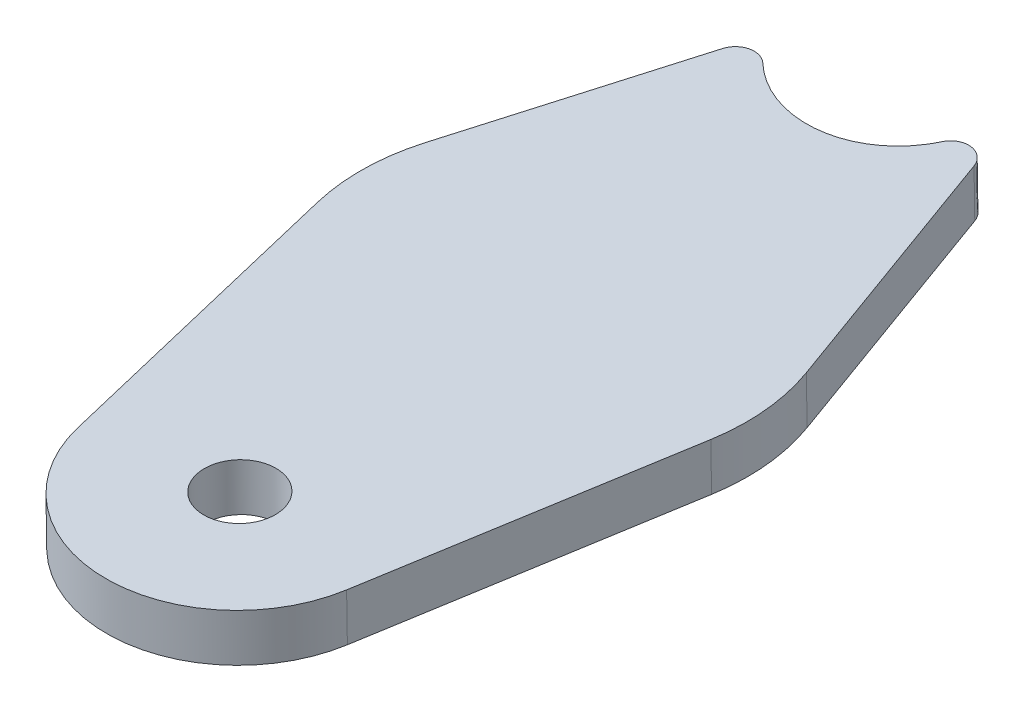
ISO-10303-21;
HEADER;
FILE_DESCRIPTION(('STEP AP214'),'2;1');
FILE_NAME('part.step','',(''),(''),'','','');
FILE_SCHEMA(('AUTOMOTIVE_DESIGN { 1 0 10303 214 1 1 1 1 }'));
ENDSEC;
DATA;
#1=APPLICATION_CONTEXT('core data for automotive mechanical design processes');
#2=APPLICATION_PROTOCOL_DEFINITION('international standard','automotive_design',2000,#1);
#3=PRODUCT_CONTEXT('',#1,'mechanical');
#4=PRODUCT('Part','Part','',(#3));
#5=PRODUCT_RELATED_PRODUCT_CATEGORY('part','',(#4));
#6=PRODUCT_DEFINITION_FORMATION('','',#4);
#7=PRODUCT_DEFINITION_CONTEXT('part definition',#1,'design');
#8=PRODUCT_DEFINITION('design','',#6,#7);
#9=PRODUCT_DEFINITION_SHAPE('','',#8);
#10=(LENGTH_UNIT() NAMED_UNIT(*) SI_UNIT(.MILLI.,.METRE.));
#11=(NAMED_UNIT(*) PLANE_ANGLE_UNIT() SI_UNIT($,.RADIAN.));
#12=(NAMED_UNIT(*) SI_UNIT($,.STERADIAN.) SOLID_ANGLE_UNIT());
#13=UNCERTAINTY_MEASURE_WITH_UNIT(LENGTH_MEASURE(1.E-05),#10,'distance_accuracy_value','');
#14=(GEOMETRIC_REPRESENTATION_CONTEXT(3) GLOBAL_UNCERTAINTY_ASSIGNED_CONTEXT((#13)) GLOBAL_UNIT_ASSIGNED_CONTEXT((#10,
#11,#12)) REPRESENTATION_CONTEXT('',''));
#15=CARTESIAN_POINT('',(0.,0.,0.));
#16=DIRECTION('',(0.,0.,1.));
#17=DIRECTION('',(1.,0.,0.));
#18=AXIS2_PLACEMENT_3D('',#15,#16,#17);
#19=CARTESIAN_POINT('',(-0.370440133779489,-19.1401560113368,83.5571213982127));
#20=DIRECTION('',(0.0233348115766651,0.998968886682012,0.0389441909658332));
#21=DIRECTION('',(0.,-0.0389547981153577,0.999240973791503));
#22=AXIS2_PLACEMENT_3D('',#19,#20,#21);
#23=PLANE('',#22);
#24=DIRECTION('',(-0.201552589425748,0.0428558176093111,-0.978539693928056));
#25=VECTOR('',#24,1.);
#26=CARTESIAN_POINT('',(-27.1213154377897,-16.8749209764209,41.4796601508919));
#27=LINE('',#26,#25);
#28=CARTESIAN_POINT('',(-17.7162160176897,-18.8747128247599,87.141505201501));
#29=VERTEX_POINT('',#28);
#30=CARTESIAN_POINT('',(-25.7495667571363,-17.1665937920934,48.1395127379373));
#31=VERTEX_POINT('',#30);
#32=EDGE_CURVE('E234',#29,#31,#27,.T.);
#33=ORIENTED_EDGE('',*,*,#32,.T.);
#34=CARTESIAN_POINT('',(-0.877894535570292,-17.5472061079778,42.9999548612343));
#35=DIRECTION('',(0.0233348115766651,0.998968886682012,0.0389441909658332));
#36=DIRECTION('',(0.,-0.0389547981153577,0.999240973791503));
#37=AXIS2_PLACEMENT_3D('',#34,#35,#36);
#38=CIRCLE('',#37,25.4);
#39=CARTESIAN_POINT('',(-24.9771123997532,-16.6733172897904,35.0234884337932));
#40=VERTEX_POINT('',#39);
#41=EDGE_CURVE('E263',#31,#40,#38,.F.);
#42=ORIENTED_EDGE('',*,*,#41,.T.);
#43=DIRECTION('',(0.315050184239988,0.0296218583266938,-0.948612632700842));
#44=VECTOR('',#43,1.);
#45=CARTESIAN_POINT('',(-12.4200490658709,-15.4926687147931,-2.7856908780065));
#46=LINE('',#45,#44);
#47=CARTESIAN_POINT('',(-15.3985113134212,-15.7727116766507,6.18242612489119));
#48=VERTEX_POINT('',#47);
#49=EDGE_CURVE('E237',#40,#48,#46,.T.);
#50=ORIENTED_EDGE('',*,*,#49,.T.);
#51=CARTESIAN_POINT('',(-11.2385231245131,-15.8289143550089,5.13149112004866));
#52=CARTESIAN_POINT('',(-11.3942168190406,-15.8195128767865,4.98362051175755));
#53=CARTESIAN_POINT('',(-11.565282915878,-15.8106284294945,4.85822334308885));
#54=CARTESIAN_POINT('',(-11.9374030594385,-15.7938681409382,4.6512694132275));
#55=CARTESIAN_POINT('',(-12.1378475847064,-15.7860590406458,4.57105942763097));
#56=CARTESIAN_POINT('',(-12.5477098018316,-15.7723183198014,4.46417583621844));
#57=CARTESIAN_POINT('',(-12.7627291213921,-15.7662070219273,4.43624969115612));
#58=CARTESIAN_POINT('',(-13.187409495432,-15.7562413236689,4.43507914467775));
#59=CARTESIAN_POINT('',(-13.3987335444533,-15.7523134381291,4.46094619688116));
#60=CARTESIAN_POINT('',(-13.8145511609569,-15.7467158707865,4.56651342046551));
#61=CARTESIAN_POINT('',(-14.0117693272165,-15.7451362671698,4.64416489576603));
#62=CARTESIAN_POINT('',(-14.3853845601364,-15.7443515356105,4.84790050956047));
#63=CARTESIAN_POINT('',(-14.5608012592699,-15.7451906766645,4.97453278266507));
#64=CARTESIAN_POINT('',(-14.8708175876351,-15.7492083033341,5.26334752936573));
#65=CARTESIAN_POINT('',(-15.0097049096682,-15.7524460986356,5.42962049837951));
#66=CARTESIAN_POINT('',(-15.2391931225235,-15.7610326355032,5.78738238880797));
#67=CARTESIAN_POINT('',(-15.330802316721,-15.7663454962514,5.97855508202143));
#68=CARTESIAN_POINT('',(-15.3985113134212,-15.7727116766507,6.18242612489119));
#69=B_SPLINE_CURVE_WITH_KNOTS('',3,(#51,#52,#53,#54,#55,#56,#57,#58,#59,#60,#61,#62,#63,#64,#65,
#66,#67,#68),.UNSPECIFIED.,.F.,.F.,(4,2,2,2,2,2,2,2,4),(0.,0.125,0.25,0.375,0.5,0.625,0.75,
0.875,1.),.UNSPECIFIED.);
#70=CARTESIAN_POINT('',(-11.2385231245131,-15.8289143550089,5.13149112004865));
#71=VERTEX_POINT('',#70);
#72=EDGE_CURVE('E195',#48,#71,#69,.F.);
#73=ORIENTED_EDGE('',*,*,#72,.T.);
#74=CARTESIAN_POINT('',(-2.63045811623851,-15.6643798219457,-4.2468640406244));
#75=DIRECTION('',(0.0233348115766651,0.998968886682012,0.0389441909658332));
#76=DIRECTION('',(-0.528129030761471,0.0453933231349425,-0.84794998265329));
#77=AXIS2_PLACEMENT_3D('',#74,#75,#76);
#78=ELLIPSE('',#77,13.1533225438932,12.7);
#79=CARTESIAN_POINT('',(8.78514017056042,-16.1760047939744,2.03691250164753));
#80=VERTEX_POINT('',#79);
#81=EDGE_CURVE('E230',#71,#80,#78,.T.);
#82=ORIENTED_EDGE('',*,*,#81,.T.);
#83=CARTESIAN_POINT('',(13.4551012329912,-16.304565281606,2.5364803513312));
#84=CARTESIAN_POINT('',(13.3757517053268,-16.2934032178599,2.29770409520272));
#85=CARTESIAN_POINT('',(13.2651496855132,-16.2820169683873,2.07190323893351));
#86=CARTESIAN_POINT('',(12.9869033944189,-16.2593150238958,1.65629025434797));
#87=CARTESIAN_POINT('',(12.8179797020884,-16.2479475507887,1.46591656217601));
#88=CARTESIAN_POINT('',(12.438017383506,-16.2264517608242,1.14218981510035));
#89=CARTESIAN_POINT('',(12.2222601871237,-16.216070885534,1.00518561049026));
#90=CARTESIAN_POINT('',(11.766482742748,-16.1974877254498,0.801598945616007));
#91=CARTESIAN_POINT('',(11.5201906554671,-16.1890336985762,0.732316973194981));
#92=CARTESIAN_POINT('',(11.148364861003,-16.1785647451459,0.686567559594836));
#93=CARTESIAN_POINT('',(11.0235834582439,-16.1754197328993,0.680661188062039));
#94=CARTESIAN_POINT('',(10.7722833463789,-16.1698429470406,0.688184908332925));
#95=CARTESIAN_POINT('',(10.6459622736632,-16.1674239542052,0.701824422652291));
#96=CARTESIAN_POINT('',(10.4002454803013,-16.1634768517143,0.747806183961931));
#97=CARTESIAN_POINT('',(10.2797390430158,-16.1619223875239,0.780137928823103));
#98=CARTESIAN_POINT('',(10.0434757912021,-16.1596597770759,0.863664661377136));
#99=CARTESIAN_POINT('',(9.92700993038573,-16.1589556868411,0.915388541866989));
#100=CARTESIAN_POINT('',(9.5964489156065,-16.1582023666428,1.09413241565105));
#101=CARTESIAN_POINT('',(9.39548898946066,-16.1594634999288,1.24689447792989));
#102=CARTESIAN_POINT('',(9.04537649739976,-16.1653845974671,1.60856077268089));
#103=CARTESIAN_POINT('',(8.90052902988799,-16.1699245865655,1.81180793280021));
#104=CARTESIAN_POINT('',(8.78514017056043,-16.1760047939744,2.03691250164753));
#105=B_SPLINE_CURVE_WITH_KNOTS('',3,(#83,#84,#85,#86,#87,#88,#89,#90,#91,#92,#93,#94,#95,#96,
#97,#98,#99,#100,#101,#102,#103,#104),.UNSPECIFIED.,.F.,.F.,(4,2,2,2,2,2,2,2,2,2,4),(0.,0.125,
0.25,0.374999999999999,0.499999999999999,0.562499999999999,0.625,0.6875,0.75,0.875,1.),.UNSPECIFIED.);
#106=CARTESIAN_POINT('',(13.4551012329912,-16.304565281606,2.5364803513312));
#107=VERTEX_POINT('',#106);
#108=EDGE_CURVE('E256',#80,#107,#105,.F.);
#109=ORIENTED_EDGE('',*,*,#108,.T.);
#110=DIRECTION('',(0.315050184239988,-0.0443179731905001,0.948039713652669));
#111=VECTOR('',#110,1.);
#112=CARTESIAN_POINT('',(11.679168798312,-16.0547456339263,-2.80760310286959));
#113=LINE('',#112,#111);
#114=CARTESIAN_POINT('',(24.2362321321942,-17.8211423034756,34.9787411777733));
#115=VERTEX_POINT('',#114);
#116=EDGE_CURVE('E134',#107,#115,#113,.T.);
#117=ORIENTED_EDGE('',*,*,#116,.T.);
#118=CARTESIAN_POINT('',(0.137014268011312,-17.5708772833966,42.9990320549406));
#119=DIRECTION('',(0.0233348115766651,0.998968886682012,0.0389441909658332));
#120=DIRECTION('',(0.,-0.0389547981153577,0.999240973791503));
#121=AXIS2_PLACEMENT_3D('',#118,#119,#120);
#122=CIRCLE('',#121,25.4);
#123=CARTESIAN_POINT('',(25.0086864895773,-18.350451407983,48.093360772962));
#124=VERTEX_POINT('',#123);
#125=EDGE_CURVE('E58',#115,#124,#122,.F.);
#126=ORIENTED_EDGE('',*,*,#125,.T.);
#127=DIRECTION('',(-0.201552589425748,-0.0334540138540019,0.978906217496258));
#128=VECTOR('',#127,1.);
#129=CARTESIAN_POINT('',(26.3804351702307,-18.1227664176907,41.4310136596863));
#130=LINE('',#129,#128);
#131=CARTESIAN_POINT('',(16.9753357501307,-19.6838395212154,87.1099618921923));
#132=VERTEX_POINT('',#131);
#133=EDGE_CURVE('E238',#124,#132,#130,.T.);
#134=ORIENTED_EDGE('',*,*,#133,.T.);
#135=CARTESIAN_POINT('',(-0.370440133779489,-19.1401560113368,83.5571213982127));
#136=DIRECTION('',(-0.0233348115766651,-0.998968886682012,-0.0389441909658332));
#137=DIRECTION('',(0.,-0.0389547981153577,0.999240973791503));
#138=AXIS2_PLACEMENT_3D('',#135,#136,#137);
#139=CIRCLE('',#138,17.7142374475848);
#140=EDGE_CURVE('E231',#132,#29,#139,.T.);
#141=ORIENTED_EDGE('',*,*,#140,.T.);
#142=EDGE_LOOP('',(#33,#42,#50,#73,#82,#109,#117,#126,#134,#141));
#143=FACE_BOUND('',#142,.T.);
#144=CARTESIAN_POINT('',(-0.370440133779489,-19.1401560113368,83.5571213982127));
#145=DIRECTION('',(-0.0233348115766651,-0.998968886682012,-0.0389441909658332));
#146=DIRECTION('',(0.,0.0389547981153577,-0.999240973791503));
#147=AXIS2_PLACEMENT_3D('',#144,#145,#146);
#148=CIRCLE('',#147,4.7625);
#149=CARTESIAN_POINT('',(-0.370440133779489,-19.3256782373612,88.3160065358947));
#150=VERTEX_POINT('',#149);
#151=EDGE_CURVE('E223',#150,#150,#148,.T.);
#152=ORIENTED_EDGE('',*,*,#151,.F.);
#153=EDGE_LOOP('',(#152));
#154=FACE_BOUND('',#153,.T.);
#155=ADVANCED_FACE('F41',(#143,#154),#23,.F.);
#156=CARTESIAN_POINT('',(-0.222264080267666,-12.796703580906,83.8044170108458));
#157=DIRECTION('',(0.0233348115766651,0.998968886682012,0.0389441909658332));
#158=DIRECTION('',(0.,-0.0389547981153577,0.999240973791503));
#159=AXIS2_PLACEMENT_3D('',#156,#157,#158);
#160=PLANE('',#159);
#161=CARTESIAN_POINT('',(-15.2503352599093,-9.42925924621992,6.42972173752423));
#162=CARTESIAN_POINT('',(-15.1826262632091,-9.42289306582064,6.22585069465447));
#163=CARTESIAN_POINT('',(-15.0910170690117,-9.4175802050725,6.03467800144101));
#164=CARTESIAN_POINT('',(-14.8615288561564,-9.40899366820487,5.67691611101255));
#165=CARTESIAN_POINT('',(-14.7226415341233,-9.40575587290332,5.51064314199877));
#166=CARTESIAN_POINT('',(-14.4126252057581,-9.40173824623379,5.22182839529811));
#167=CARTESIAN_POINT('',(-14.2372085066246,-9.40089910517973,5.0951961221935));
#168=CARTESIAN_POINT('',(-13.8635932737047,-9.4016838367391,4.89146050839907));
#169=CARTESIAN_POINT('',(-13.6663751074451,-9.4032634403557,4.81380903309855));
#170=CARTESIAN_POINT('',(-13.2505574909415,-9.4088610076983,4.7082418095142));
#171=CARTESIAN_POINT('',(-13.0392334419201,-9.4127888932382,4.68237475731079));
#172=CARTESIAN_POINT('',(-12.6145530678803,-9.42275459149651,4.68354530378916));
#173=CARTESIAN_POINT('',(-12.3995337483197,-9.42886588937068,4.71147144885148));
#174=CARTESIAN_POINT('',(-11.9896715311946,-9.44260661021502,4.818355040264));
#175=CARTESIAN_POINT('',(-11.7892270059266,-9.45041571050749,4.89856502586054));
#176=CARTESIAN_POINT('',(-11.4171068623662,-9.46717599906374,5.10551895572189));
#177=CARTESIAN_POINT('',(-11.2460407655287,-9.47606044635572,5.23091612439059));
#178=CARTESIAN_POINT('',(-11.0903470710013,-9.48546192457814,5.3787867326817));
#179=B_SPLINE_CURVE_WITH_KNOTS('',3,(#161,#162,#163,#164,#165,#166,#167,#168,#169,#170,#171,
#172,#173,#174,#175,#176,#177,#178),.UNSPECIFIED.,.F.,.F.,(4,2,2,2,2,2,2,2,4),(0.,0.125,0.25,
0.375,0.5,0.625,0.75,0.875,1.),.UNSPECIFIED.);
#180=CARTESIAN_POINT('',(-15.2503352599093,-9.42925924621988,6.42972173752423));
#181=VERTEX_POINT('',#180);
#182=CARTESIAN_POINT('',(-11.0903470710013,-9.48546192457814,5.3787867326817));
#183=VERTEX_POINT('',#182);
#184=EDGE_CURVE('E153',#181,#183,#179,.T.);
#185=ORIENTED_EDGE('',*,*,#184,.F.);
#186=DIRECTION('',(0.315050184239988,0.0296218583266938,-0.948612632700842));
#187=VECTOR('',#186,1.);
#188=CARTESIAN_POINT('',(-12.2718730123591,-9.14921628436233,-2.53839526537346));
#189=LINE('',#188,#187);
#190=CARTESIAN_POINT('',(-24.8289363462414,-10.3298648593596,35.2707840464263));
#191=VERTEX_POINT('',#190);
#192=EDGE_CURVE('E129',#191,#181,#189,.T.);
#193=ORIENTED_EDGE('',*,*,#192,.F.);
#194=CARTESIAN_POINT('',(-0.729718482058469,-11.203753677547,43.2472504738674));
#195=DIRECTION('',(0.0233348115766651,0.998968886682012,0.0389441909658332));
#196=DIRECTION('',(0.,-0.0389547981153577,0.999240973791503));
#197=AXIS2_PLACEMENT_3D('',#194,#195,#196);
#198=CIRCLE('',#197,25.4);
#199=CARTESIAN_POINT('',(-25.6013907036245,-10.8231413616626,48.3868083505704));
#200=VERTEX_POINT('',#199);
#201=EDGE_CURVE('E258',#191,#200,#198,.T.);
#202=ORIENTED_EDGE('',*,*,#201,.T.);
#203=DIRECTION('',(-0.201552589425748,0.0428558176093111,-0.978539693928056));
#204=VECTOR('',#203,1.);
#205=CARTESIAN_POINT('',(-26.9731393842778,-10.5314685459901,41.7269557635249));
#206=LINE('',#205,#204);
#207=CARTESIAN_POINT('',(-17.5680399641779,-12.5312603943292,87.388800814134));
#208=VERTEX_POINT('',#207);
#209=EDGE_CURVE('E243',#208,#200,#206,.T.);
#210=ORIENTED_EDGE('',*,*,#209,.F.);
#211=CARTESIAN_POINT('',(-0.222264080267666,-12.796703580906,83.8044170108458));
#212=DIRECTION('',(-0.0233348115766651,-0.998968886682012,-0.0389441909658332));
#213=DIRECTION('',(0.,-0.0389547981153577,0.999240973791503));
#214=AXIS2_PLACEMENT_3D('',#211,#212,#213);
#215=CIRCLE('',#214,17.7142374475848);
#216=CARTESIAN_POINT('',(17.1235118036425,-13.3403870907846,87.3572575048254));
#217=VERTEX_POINT('',#216);
#218=EDGE_CURVE('E226',#217,#208,#215,.T.);
#219=ORIENTED_EDGE('',*,*,#218,.F.);
#220=DIRECTION('',(-0.201552589425748,-0.0334540138540019,0.978906217496258));
#221=VECTOR('',#220,1.);
#222=CARTESIAN_POINT('',(26.5286112237425,-11.7793139872599,41.6783092723193));
#223=LINE('',#222,#221);
#224=CARTESIAN_POINT('',(25.1568625430891,-12.0069989775522,48.3406563855951));
#225=VERTEX_POINT('',#224);
#226=EDGE_CURVE('E128',#225,#217,#223,.T.);
#227=ORIENTED_EDGE('',*,*,#226,.F.);
#228=CARTESIAN_POINT('',(0.285190321523136,-11.2274248529658,43.2463276675736));
#229=DIRECTION('',(0.0233348115766651,0.998968886682012,0.0389441909658332));
#230=DIRECTION('',(0.,-0.0389547981153577,0.999240973791503));
#231=AXIS2_PLACEMENT_3D('',#228,#229,#230);
#232=CIRCLE('',#231,25.4);
#233=CARTESIAN_POINT('',(24.384408185706,-11.4776898730448,35.2260367904063));
#234=VERTEX_POINT('',#233);
#235=EDGE_CURVE('E127',#225,#234,#232,.T.);
#236=ORIENTED_EDGE('',*,*,#235,.T.);
#237=DIRECTION('',(0.315050184239988,-0.0443179731905001,0.948039713652669));
#238=VECTOR('',#237,1.);
#239=CARTESIAN_POINT('',(11.8273448518238,-9.71129320349554,-2.56030749023655));
#240=LINE('',#239,#238);
#241=CARTESIAN_POINT('',(13.6032772865031,-9.96111285117525,2.78377596396424));
#242=VERTEX_POINT('',#241);
#243=EDGE_CURVE('E118',#242,#234,#240,.T.);
#244=ORIENTED_EDGE('',*,*,#243,.F.);
#245=CARTESIAN_POINT('',(8.93331622407225,-9.83255236354362,2.28420811428057));
#246=CARTESIAN_POINT('',(9.04870508339981,-9.82647215613478,2.05910354543325));
#247=CARTESIAN_POINT('',(9.19355255091159,-9.82193216703635,1.85585638531393));
#248=CARTESIAN_POINT('',(9.54366504297249,-9.816011069498,1.49419009056293));
#249=CARTESIAN_POINT('',(9.74462496911832,-9.81474993621202,1.34142802828409));
#250=CARTESIAN_POINT('',(10.0751859838976,-9.81550325641035,1.16268415450003));
#251=CARTESIAN_POINT('',(10.1916518447139,-9.81620734664515,1.11096027401017));
#252=CARTESIAN_POINT('',(10.4279150965277,-9.81846995709315,1.02743354145614));
#253=CARTESIAN_POINT('',(10.5484215338132,-9.82002442128357,0.99510179659497));
#254=CARTESIAN_POINT('',(10.794138327175,-9.82397152377446,0.94912003528533));
#255=CARTESIAN_POINT('',(10.9204593998907,-9.82639051660983,0.935480520965964));
#256=CARTESIAN_POINT('',(11.1717595117558,-9.83196730246856,0.927956800695078));
#257=CARTESIAN_POINT('',(11.2965409145148,-9.83511231471512,0.933863172227874));
#258=CARTESIAN_POINT('',(11.6683667089789,-9.84558126814541,0.97961258582802));
#259=CARTESIAN_POINT('',(11.9146587962598,-9.85403529501909,1.04889455824905));
#260=CARTESIAN_POINT('',(12.3704362406355,-9.8726184551033,1.25248122312329));
#261=CARTESIAN_POINT('',(12.5861934370178,-9.88299933039341,1.38948542773339));
#262=CARTESIAN_POINT('',(12.9661557556002,-9.90449512035794,1.71321217480905));
#263=CARTESIAN_POINT('',(13.1350794479307,-9.91586259346504,1.90358586698101));
#264=CARTESIAN_POINT('',(13.413325739025,-9.93856453795652,2.31919885156655));
#265=CARTESIAN_POINT('',(13.5239277588387,-9.94995078742913,2.54499970783575));
#266=CARTESIAN_POINT('',(13.6032772865031,-9.96111285117525,2.78377596396424));
#267=B_SPLINE_CURVE_WITH_KNOTS('',3,(#245,#246,#247,#248,#249,#250,#251,#252,#253,#254,#255,
#256,#257,#258,#259,#260,#261,#262,#263,#264,#265,#266),.UNSPECIFIED.,.F.,.F.,(4,2,2,2,2,2,2,2,
2,2,4),(0.,0.125,0.25,0.3125,0.375,0.437500000000001,0.500000000000001,0.625000000000001,0.75,
0.875,1.),.UNSPECIFIED.);
#268=CARTESIAN_POINT('',(8.93331622407225,-9.83255236354362,2.28420811428057));
#269=VERTEX_POINT('',#268);
#270=EDGE_CURVE('E124',#269,#242,#267,.T.);
#271=ORIENTED_EDGE('',*,*,#270,.F.);
#272=CARTESIAN_POINT('',(-2.48228206272668,-9.32092739151492,-3.99956842799135));
#273=DIRECTION('',(0.023334811576665,0.998968886682012,0.038944190965833));
#274=DIRECTION('',(-0.528129030761471,0.0453933231349424,-0.847949982653291));
#275=AXIS2_PLACEMENT_3D('',#272,#273,#274);
#276=ELLIPSE('',#275,13.1533225438932,12.7);
#277=EDGE_CURVE('E137',#183,#269,#276,.T.);
#278=ORIENTED_EDGE('',*,*,#277,.F.);
#279=EDGE_LOOP('',(#185,#193,#202,#210,#219,#227,#236,#244,#271,#278));
#280=FACE_BOUND('',#279,.T.);
#281=CARTESIAN_POINT('',(-0.222264080267666,-12.796703580906,83.8044170108458));
#282=DIRECTION('',(-0.0233348115766651,-0.998968886682012,-0.0389441909658332));
#283=DIRECTION('',(0.,0.0389547981153577,-0.999240973791503));
#284=AXIS2_PLACEMENT_3D('',#281,#282,#283);
#285=CIRCLE('',#284,4.7625);
#286=CARTESIAN_POINT('',(-0.222264080267666,-12.9822258069304,88.5633021485278));
#287=VERTEX_POINT('',#286);
#288=EDGE_CURVE('E227',#287,#287,#285,.T.);
#289=ORIENTED_EDGE('',*,*,#288,.T.);
#290=EDGE_LOOP('',(#289));
#291=FACE_BOUND('',#290,.T.);
#292=ADVANCED_FACE('F121',(#280,#291),#160,.T.);
#293=CARTESIAN_POINT('',(-0.370440133779489,-19.1401560113368,83.5571213982127));
#294=DIRECTION('',(0.0233348115766651,0.998968886682012,0.0389441909658332));
#295=DIRECTION('',(0.,-0.0389547981153577,0.999240973791503));
#296=AXIS2_PLACEMENT_3D('',#293,#294,#295);
#297=CYLINDRICAL_SURFACE('',#296,17.7142374475848);
#298=ORIENTED_EDGE('',*,*,#218,.T.);
#299=DIRECTION('',(0.0233348115766651,0.998968886682012,0.0389441909658332));
#300=VECTOR('',#299,1.);
#301=CARTESIAN_POINT('',(-17.7162160176897,-18.8747128247599,87.141505201501));
#302=LINE('',#301,#300);
#303=EDGE_CURVE('E250',#29,#208,#302,.T.);
#304=ORIENTED_EDGE('',*,*,#303,.F.);
#305=ORIENTED_EDGE('',*,*,#140,.F.);
#306=DIRECTION('',(0.0233348115766651,0.998968886682012,0.0389441909658332));
#307=VECTOR('',#306,1.);
#308=CARTESIAN_POINT('',(16.9753357501307,-19.6838395212154,87.1099618921923));
#309=LINE('',#308,#307);
#310=EDGE_CURVE('E240',#132,#217,#309,.T.);
#311=ORIENTED_EDGE('',*,*,#310,.T.);
#312=EDGE_LOOP('',(#298,#304,#305,#311));
#313=FACE_BOUND('',#312,.T.);
#314=ADVANCED_FACE('F306',(#313),#297,.T.);
#315=CARTESIAN_POINT('',(-27.1213154377897,-16.8749209764209,41.4796601508919));
#316=DIRECTION('',(0.979199693762441,-0.0149847368458442,-0.202344798295394));
#317=DIRECTION('',(-0.202367519608968,0.,-0.979309648174322));
#318=AXIS2_PLACEMENT_3D('',#315,#316,#317);
#319=PLANE('',#318);
#320=ORIENTED_EDGE('',*,*,#209,.T.);
#321=DIRECTION('',(0.0233348115766651,0.998968886682012,0.0389441909658332));
#322=VECTOR('',#321,1.);
#323=CARTESIAN_POINT('',(-25.7495667571363,-17.1665937920934,48.1395127379373));
#324=LINE('',#323,#322);
#325=EDGE_CURVE('E260',#200,#31,#324,.F.);
#326=ORIENTED_EDGE('',*,*,#325,.T.);
#327=ORIENTED_EDGE('',*,*,#32,.F.);
#328=ORIENTED_EDGE('',*,*,#303,.T.);
#329=EDGE_LOOP('',(#320,#326,#327,#328));
#330=FACE_BOUND('',#329,.T.);
#331=ADVANCED_FACE('F378',(#330),#319,.F.);
#332=CARTESIAN_POINT('',(-12.4200490658709,-15.4926687147931,-2.7856908780065));
#333=DIRECTION('',(0.94878810488909,-0.0344050715821814,0.31403411131658));
#334=DIRECTION('',(0.314220138979013,0.,-0.949350148396265));
#335=AXIS2_PLACEMENT_3D('',#332,#333,#334);
#336=PLANE('',#335);
#337=ORIENTED_EDGE('',*,*,#49,.F.);
#338=DIRECTION('',(0.0233348115766651,0.998968886682012,0.0389441909658332));
#339=VECTOR('',#338,1.);
#340=CARTESIAN_POINT('',(-24.9771123997532,-16.6733172897904,35.0234884337932));
#341=LINE('',#340,#339);
#342=EDGE_CURVE('E253',#40,#191,#341,.T.);
#343=ORIENTED_EDGE('',*,*,#342,.T.);
#344=ORIENTED_EDGE('',*,*,#192,.T.);
#345=DIRECTION('',(-0.023334811576665,-0.998968886682012,-0.038944190965833));
#346=VECTOR('',#345,1.);
#347=CARTESIAN_POINT('',(-12.6091645709798,103.639892136838,10.8376534384123));
#348=LINE('',#347,#346);
#349=EDGE_CURVE('E184',#181,#48,#348,.T.);
#350=ORIENTED_EDGE('',*,*,#349,.T.);
#351=EDGE_LOOP('',(#337,#343,#344,#350));
#352=FACE_BOUND('',#351,.T.);
#353=ADVANCED_FACE('F316',(#352),#336,.F.);
#354=CARTESIAN_POINT('',(11.679168798312,-16.0547456339263,-2.80760310286959));
#355=DIRECTION('',(-0.94878810488909,0.00985295354641755,0.315759483353044));
#356=DIRECTION('',(0.315774811543932,0.,0.948834162746259));
#357=AXIS2_PLACEMENT_3D('',#354,#355,#356);
#358=PLANE('',#357);
#359=ORIENTED_EDGE('',*,*,#243,.T.);
#360=DIRECTION('',(0.0233348115766651,0.998968886682012,0.0389441909658332));
#361=VECTOR('',#360,1.);
#362=CARTESIAN_POINT('',(24.2362321321942,-17.8211423034756,34.9787411777733));
#363=LINE('',#362,#361);
#364=EDGE_CURVE('E11',#234,#115,#363,.F.);
#365=ORIENTED_EDGE('',*,*,#364,.T.);
#366=ORIENTED_EDGE('',*,*,#116,.F.);
#367=DIRECTION('',(-0.023334811576665,-0.998968886682012,-0.038944190965833));
#368=VECTOR('',#367,1.);
#369=CARTESIAN_POINT('',(16.2444479754326,103.108038531883,7.1917076648523));
#370=LINE('',#369,#368);
#371=EDGE_CURVE('E132',#242,#107,#370,.T.);
#372=ORIENTED_EDGE('',*,*,#371,.F.);
#373=EDGE_LOOP('',(#359,#365,#366,#372));
#374=FACE_BOUND('',#373,.T.);
#375=ADVANCED_FACE('F133',(#374),#358,.F.);
#376=CARTESIAN_POINT('',(26.3804351702307,-18.1227664176907,41.4310136596863));
#377=DIRECTION('',(-0.979199693762441,0.0306918946687556,-0.20056412275675));
#378=DIRECTION('',(-0.200658654487634,0.,0.979661219187129));
#379=AXIS2_PLACEMENT_3D('',#376,#377,#378);
#380=PLANE('',#379);
#381=ORIENTED_EDGE('',*,*,#133,.F.);
#382=DIRECTION('',(0.0233348115766651,0.998968886682012,0.0389441909658332));
#383=VECTOR('',#382,1.);
#384=CARTESIAN_POINT('',(25.0086864895773,-18.350451407983,48.093360772962));
#385=LINE('',#384,#383);
#386=EDGE_CURVE('E50',#124,#225,#385,.T.);
#387=ORIENTED_EDGE('',*,*,#386,.T.);
#388=ORIENTED_EDGE('',*,*,#226,.T.);
#389=ORIENTED_EDGE('',*,*,#310,.F.);
#390=EDGE_LOOP('',(#381,#387,#388,#389));
#391=FACE_BOUND('',#390,.T.);
#392=ADVANCED_FACE('F301',(#391),#380,.F.);
#393=CARTESIAN_POINT('',(-0.370440133779489,-19.1401560113368,83.5571213982127));
#394=DIRECTION('',(0.0233348115766651,0.998968886682012,0.0389441909658332));
#395=DIRECTION('',(0.,-0.0389547981153577,0.999240973791503));
#396=AXIS2_PLACEMENT_3D('',#393,#394,#395);
#397=CYLINDRICAL_SURFACE('',#396,4.7625);
#398=CARTESIAN_POINT('',(-0.370440133779489,-19.3256782373612,88.3160065358947));
#399=CARTESIAN_POINT('',(-0.368896633222075,-19.2596006078775,88.3185825318597));
#400=CARTESIAN_POINT('',(-0.36735313266466,-19.1935229783939,88.3211585278246));
#401=CARTESIAN_POINT('',(-0.36426613154983,-19.0613677194266,88.3263105197545));
#402=CARTESIAN_POINT('',(-0.362722630992415,-18.9952900899429,88.3288865157194));
#403=CARTESIAN_POINT('',(-0.359635629877586,-18.8631348309756,88.3340385076492));
#404=CARTESIAN_POINT('',(-0.358092129320171,-18.7970572014919,88.3366145036142));
#405=CARTESIAN_POINT('',(-0.355005128205341,-18.6649019425246,88.341766495544));
#406=CARTESIAN_POINT('',(-0.353461627647926,-18.598824313041,88.344342491509));
#407=CARTESIAN_POINT('',(-0.350374626533097,-18.4666690540737,88.3494944834388));
#408=CARTESIAN_POINT('',(-0.348831125975682,-18.40059142459,88.3520704794037));
#409=CARTESIAN_POINT('',(-0.345744124860852,-18.2684361656227,88.3572224713336));
#410=CARTESIAN_POINT('',(-0.344200624303437,-18.2023585361391,88.3597984672985));
#411=CARTESIAN_POINT('',(-0.341113623188608,-18.0702032771717,88.3649504592284));
#412=CARTESIAN_POINT('',(-0.339570122631193,-18.0041256476881,88.3675264551933));
#413=CARTESIAN_POINT('',(-0.336483121516363,-17.8719703887208,88.3726784471231));
#414=CARTESIAN_POINT('',(-0.334939620958948,-17.8058927592371,88.3752544430881));
#415=CARTESIAN_POINT('',(-0.331852619844119,-17.6737375002698,88.3804064350179));
#416=CARTESIAN_POINT('',(-0.330309119286704,-17.6076598707862,88.3829824309829));
#417=CARTESIAN_POINT('',(-0.327222118171874,-17.4755046118189,88.3881344229127));
#418=CARTESIAN_POINT('',(-0.325678617614459,-17.4094269823352,88.3907104188776));
#419=CARTESIAN_POINT('',(-0.32259161649963,-17.2772717233679,88.3958624108075));
#420=CARTESIAN_POINT('',(-0.321048115942215,-17.2111940938842,88.3984384067724));
#421=CARTESIAN_POINT('',(-0.317961114827385,-17.0790388349169,88.4035903987023));
#422=CARTESIAN_POINT('',(-0.316417614269971,-17.0129612054333,88.4061663946672));
#423=CARTESIAN_POINT('',(-0.313330613155141,-16.880805946466,88.4113183865971));
#424=CARTESIAN_POINT('',(-0.311787112597726,-16.8147283169823,88.413894382562));
#425=CARTESIAN_POINT('',(-0.308700111482896,-16.682573058015,88.4190463744918));
#426=CARTESIAN_POINT('',(-0.307156610925482,-16.6164954285314,88.4216223704568));
#427=CARTESIAN_POINT('',(-0.304069609810652,-16.4843401695641,88.4267743623866));
#428=CARTESIAN_POINT('',(-0.302526109253237,-16.4182625400804,88.4293503583516));
#429=CARTESIAN_POINT('',(-0.299439108138407,-16.2861072811131,88.4345023502814));
#430=CARTESIAN_POINT('',(-0.297895607580993,-16.2200296516294,88.4370783462463));
#431=CARTESIAN_POINT('',(-0.294808606466163,-16.0878743926621,88.4422303381762));
#432=CARTESIAN_POINT('',(-0.293265105908748,-16.0217967631785,88.4448063341411));
#433=CARTESIAN_POINT('',(-0.290178104793918,-15.8896415042112,88.449958326071));
#434=CARTESIAN_POINT('',(-0.288634604236504,-15.8235638747275,88.4525343220359));
#435=CARTESIAN_POINT('',(-0.285547603121674,-15.6914086157602,88.4576863139658));
#436=CARTESIAN_POINT('',(-0.284004102564259,-15.6253309862766,88.4602623099307));
#437=CARTESIAN_POINT('',(-0.280917101449429,-15.4931757273092,88.4654143018605));
#438=CARTESIAN_POINT('',(-0.279373600892015,-15.4270980978256,88.4679902978255));
#439=CARTESIAN_POINT('',(-0.276286599777185,-15.2949428388583,88.4731422897553));
#440=CARTESIAN_POINT('',(-0.27474309921977,-15.2288652093746,88.4757182857202));
#441=CARTESIAN_POINT('',(-0.271656098104941,-15.0967099504073,88.4808702776501));
#442=CARTESIAN_POINT('',(-0.270112597547526,-15.0306323209237,88.483446273615));
#443=CARTESIAN_POINT('',(-0.267025596432696,-14.8984770619564,88.4885982655449));
#444=CARTESIAN_POINT('',(-0.265482095875281,-14.8323994324727,88.4911742615098));
#445=CARTESIAN_POINT('',(-0.262395094760452,-14.7002441735054,88.4963262534397));
#446=CARTESIAN_POINT('',(-0.260851594203037,-14.6341665440217,88.4989022494046));
#447=CARTESIAN_POINT('',(-0.257764593088207,-14.5020112850544,88.5040542413344));
#448=CARTESIAN_POINT('',(-0.256221092530792,-14.4359336555708,88.5066302372994));
#449=CARTESIAN_POINT('',(-0.253134091415963,-14.3037783966035,88.5117822292292));
#450=CARTESIAN_POINT('',(-0.251590590858548,-14.2377007671198,88.5143582251942));
#451=CARTESIAN_POINT('',(-0.248503589743718,-14.1055455081525,88.519510217124));
#452=CARTESIAN_POINT('',(-0.246960089186303,-14.0394678786689,88.522086213089));
#453=CARTESIAN_POINT('',(-0.243873088071474,-13.9073126197016,88.5272382050188));
#454=CARTESIAN_POINT('',(-0.242329587514059,-13.8412349902179,88.5298142009837));
#455=CARTESIAN_POINT('',(-0.239242586399229,-13.7090797312506,88.5349661929136));
#456=CARTESIAN_POINT('',(-0.237699085841814,-13.6430021017669,88.5375421888785));
#457=CARTESIAN_POINT('',(-0.234612084726985,-13.5108468427996,88.5426941808084));
#458=CARTESIAN_POINT('',(-0.23306858416957,-13.444769213316,88.5452701767733));
#459=CARTESIAN_POINT('',(-0.22998158305474,-13.3126139543487,88.5504221687032));
#460=CARTESIAN_POINT('',(-0.228438082497325,-13.246536324865,88.5529981646681));
#461=CARTESIAN_POINT('',(-0.225351081382496,-13.1143810658977,88.5581501565979));
#462=CARTESIAN_POINT('',(-0.223807580825081,-13.0483034364141,88.5607261525629));
#463=CARTESIAN_POINT('',(-0.222264080267666,-12.9822258069304,88.5633021485278));
#464=B_SPLINE_CURVE_WITH_KNOTS('',3,(#398,#399,#400,#401,#402,#403,#404,#405,#406,#407,#408,
#409,#410,#411,#412,#413,#414,#415,#416,#417,#418,#419,#420,#421,#422,#423,#424,#425,#426,#427,
#428,#429,#430,#431,#432,#433,#434,#435,#436,#437,#438,#439,#440,#441,#442,#443,#444,#445,#446,
#447,#448,#449,#450,#451,#452,#453,#454,#455,#456,#457,#458,#459,#460,#461,#462,#463),
.UNSPECIFIED.,.F.,.F.,(4,2,2,2,2,2,2,2,2,2,2,2,2,2,2,2,2,2,2,2,2,2,2,2,2,2,2,2,2,2,2,2,4),(0.,
0.198437500000003,0.396875000000004,0.595312500000003,0.793750000000003,0.992187500000003,
1.190625,1.3890625,1.5875,1.7859375,1.984375,2.1828125,2.38125,2.5796875,2.778125,2.9765625,
3.175,3.3734375,3.571875,3.7703125,3.96875,4.1671875,4.365625,4.5640625,4.7625,4.9609375,
5.159375,5.3578125,5.55625000000001,5.7546875,5.953125,6.15156250000001,6.35000000000001),.UNSPECIFIED.);
#465=EDGE_CURVE('BSEAM206',#150,#287,#464,.T.);
#466=ORIENTED_EDGE('',*,*,#151,.T.);
#467=ORIENTED_EDGE('',*,*,#288,.F.);
#468=ORIENTED_EDGE('',*,*,#465,.T.);
#469=ORIENTED_EDGE('',*,*,#465,.F.);
#470=EDGE_LOOP('',(#466,#468,#467,#469));
#471=FACE_BOUND('',#470,.T.);
#472=ADVANCED_FACE('F206',(#471),#397,.F.);
#473=CARTESIAN_POINT('',(-0.877894535570292,-17.5472061079778,42.9999548612343));
#474=DIRECTION('',(0.0233348115766651,0.998968886682012,0.0389441909658332));
#475=DIRECTION('',(0.,-0.0389547981153577,0.999240973791503));
#476=AXIS2_PLACEMENT_3D('',#473,#474,#475);
#477=CYLINDRICAL_SURFACE('',#476,25.4);
#478=ORIENTED_EDGE('',*,*,#41,.F.);
#479=ORIENTED_EDGE('',*,*,#325,.F.);
#480=ORIENTED_EDGE('',*,*,#201,.F.);
#481=ORIENTED_EDGE('',*,*,#342,.F.);
#482=EDGE_LOOP('',(#478,#479,#480,#481));
#483=FACE_BOUND('',#482,.T.);
#484=ADVANCED_FACE('F313',(#483),#477,.T.);
#485=CARTESIAN_POINT('',(0.137014268011312,-17.5708772833966,42.9990320549406));
#486=DIRECTION('',(0.0233348115766651,0.998968886682012,0.0389441909658332));
#487=DIRECTION('',(0.,-0.0389547981153577,0.999240973791503));
#488=AXIS2_PLACEMENT_3D('',#485,#486,#487);
#489=CYLINDRICAL_SURFACE('',#488,25.4);
#490=ORIENTED_EDGE('',*,*,#125,.F.);
#491=ORIENTED_EDGE('',*,*,#364,.F.);
#492=ORIENTED_EDGE('',*,*,#235,.F.);
#493=ORIENTED_EDGE('',*,*,#386,.F.);
#494=EDGE_LOOP('',(#490,#491,#492,#493));
#495=FACE_BOUND('',#494,.T.);
#496=ADVANCED_FACE('F43',(#495),#489,.T.);
#497=CARTESIAN_POINT('',(11.5744869130018,103.236599019514,6.69213981516863));
#498=CARTESIAN_POINT('',(11.6898757723293,103.242679226923,6.46703524632131));
#499=CARTESIAN_POINT('',(11.8347232398411,103.247219216022,6.26378808620199));
#500=CARTESIAN_POINT('',(12.184835731902,103.25314031356,5.90212179145099));
#501=CARTESIAN_POINT('',(12.3857956580478,103.254401446846,5.74935972917215));
#502=CARTESIAN_POINT('',(12.7163566728271,103.253648126648,5.57061585538809));
#503=CARTESIAN_POINT('',(12.8328225336434,103.252944036413,5.51889197489824));
#504=CARTESIAN_POINT('',(13.0690857854572,103.250681425965,5.4353652423442));
#505=CARTESIAN_POINT('',(13.1895922227427,103.249126961774,5.40303349748303));
#506=CARTESIAN_POINT('',(13.4353090161045,103.245179859284,5.35705173617339));
#507=CARTESIAN_POINT('',(13.5616300888202,103.242760866448,5.34341222185402));
#508=CARTESIAN_POINT('',(13.8129302006853,103.237184080589,5.33588850158314));
#509=CARTESIAN_POINT('',(13.9377116034443,103.234039068343,5.34179487311593));
#510=CARTESIAN_POINT('',(14.3095373979084,103.223570114913,5.38754428671608));
#511=CARTESIAN_POINT('',(14.5558294851893,103.215116088039,5.45682625913711));
#512=CARTESIAN_POINT('',(15.011606929565,103.196532927955,5.66041292401135));
#513=CARTESIAN_POINT('',(15.2273641259473,103.186152052665,5.79741712862145));
#514=CARTESIAN_POINT('',(15.6073264445298,103.1646562627,6.12114387569711));
#515=CARTESIAN_POINT('',(15.7762501368602,103.153288789593,6.31151756786907));
#516=CARTESIAN_POINT('',(16.0544964279545,103.130586845101,6.72713055245461));
#517=CARTESIAN_POINT('',(16.1650984477682,103.119200595629,6.95293140872381));
#518=CARTESIAN_POINT('',(16.2444479754326,103.108038531883,7.1917076648523));
#519=B_SPLINE_CURVE_WITH_KNOTS('',3,(#497,#498,#499,#500,#501,#502,#503,#504,#505,#506,#507,
#508,#509,#510,#511,#512,#513,#514,#515,#516,#517,#518),.UNSPECIFIED.,.F.,.F.,(4,2,2,2,2,2,2,2,
2,2,4),(0.,0.125,0.25,0.3125,0.375,0.437500000000001,0.500000000000001,0.625000000000001,0.75,
0.875,1.),.UNSPECIFIED.);
#520=DIRECTION('',(-0.023334811576665,-0.998968886682012,-0.038944190965833));
#521=VECTOR('',#520,1.);
#522=SURFACE_OF_LINEAR_EXTRUSION('',#519,#521);
#523=DIRECTION('',(-0.023334811576665,-0.998968886682012,-0.038944190965833));
#524=VECTOR('',#523,1.);
#525=CARTESIAN_POINT('',(11.5744869130018,103.236599019514,6.69213981516863));
#526=LINE('',#525,#524);
#527=EDGE_CURVE('E141',#269,#80,#526,.T.);
#528=ORIENTED_EDGE('',*,*,#527,.F.);
#529=ORIENTED_EDGE('',*,*,#270,.T.);
#530=ORIENTED_EDGE('',*,*,#371,.T.);
#531=ORIENTED_EDGE('',*,*,#108,.F.);
#532=EDGE_LOOP('',(#528,#529,#530,#531));
#533=FACE_BOUND('',#532,.T.);
#534=ADVANCED_FACE('F139',(#533),#522,.T.);
#535=CARTESIAN_POINT('',(0.15888862620282,103.748223991543,0.408363272896705));
#536=DIRECTION('',(0.023334811576665,0.998968886682012,0.038944190965833));
#537=DIRECTION('',(-0.528129030761471,0.0453933231349424,-0.847949982653291));
#538=AXIS2_PLACEMENT_3D('',#535,#536,#537);
#539=ELLIPSE('',#538,13.1533225438932,12.7);
#540=DIRECTION('',(-0.023334811576665,-0.998968886682012,-0.038944190965833));
#541=VECTOR('',#540,1.);
#542=SURFACE_OF_LINEAR_EXTRUSION('',#539,#541);
#543=DIRECTION('',(-0.023334811576665,-0.998968886682012,-0.038944190965833));
#544=VECTOR('',#543,1.);
#545=CARTESIAN_POINT('',(-8.44917638207176,103.58368945848,9.78671843356975));
#546=LINE('',#545,#544);
#547=EDGE_CURVE('E158',#183,#71,#546,.T.);
#548=ORIENTED_EDGE('',*,*,#547,.F.);
#549=ORIENTED_EDGE('',*,*,#277,.T.);
#550=ORIENTED_EDGE('',*,*,#527,.T.);
#551=ORIENTED_EDGE('',*,*,#81,.F.);
#552=EDGE_LOOP('',(#548,#549,#550,#551));
#553=FACE_BOUND('',#552,.T.);
#554=ADVANCED_FACE('F176',(#553),#542,.T.);
#555=CARTESIAN_POINT('',(-12.6091645709798,103.639892136838,10.8376534384123));
#556=CARTESIAN_POINT('',(-12.5414555742796,103.646258317237,10.6337823955425));
#557=CARTESIAN_POINT('',(-12.4498463800822,103.651571177985,10.4426097023291));
#558=CARTESIAN_POINT('',(-12.2203581672269,103.660157714853,10.0848478119006));
#559=CARTESIAN_POINT('',(-12.0814708451938,103.663395510155,9.91857484288683));
#560=CARTESIAN_POINT('',(-11.7714545168286,103.667413136824,9.62976009618617));
#561=CARTESIAN_POINT('',(-11.5960378176951,103.668252277878,9.50312782308156));
#562=CARTESIAN_POINT('',(-11.2224225847752,103.667467546319,9.29939220928713));
#563=CARTESIAN_POINT('',(-11.0252044185156,103.665887942702,9.22174073398661));
#564=CARTESIAN_POINT('',(-10.609386802012,103.66029037536,9.11617351040226));
#565=CARTESIAN_POINT('',(-10.3980627529906,103.65636248982,9.09030645819885));
#566=CARTESIAN_POINT('',(-9.97338237895077,103.646396791561,9.09147700467722));
#567=CARTESIAN_POINT('',(-9.75836305939023,103.640285493687,9.11940314973954));
#568=CARTESIAN_POINT('',(-9.34850084226508,103.626544772843,9.22628674115206));
#569=CARTESIAN_POINT('',(-9.14805631699713,103.61873567255,9.3064967267486));
#570=CARTESIAN_POINT('',(-8.77593617343665,103.601975383994,9.51345065660995));
#571=CARTESIAN_POINT('',(-8.60487007659922,103.593090936702,9.63884782527865));
#572=CARTESIAN_POINT('',(-8.44917638207176,103.58368945848,9.78671843356976));
#573=B_SPLINE_CURVE_WITH_KNOTS('',3,(#555,#556,#557,#558,#559,#560,#561,#562,#563,#564,#565,
#566,#567,#568,#569,#570,#571,#572),.UNSPECIFIED.,.F.,.F.,(4,2,2,2,2,2,2,2,4),(0.,0.125,0.25,
0.375,0.5,0.625,0.75,0.875,1.),.UNSPECIFIED.);
#574=DIRECTION('',(-0.023334811576665,-0.998968886682012,-0.038944190965833));
#575=VECTOR('',#574,1.);
#576=SURFACE_OF_LINEAR_EXTRUSION('',#573,#575);
#577=ORIENTED_EDGE('',*,*,#349,.F.);
#578=ORIENTED_EDGE('',*,*,#184,.T.);
#579=ORIENTED_EDGE('',*,*,#547,.T.);
#580=ORIENTED_EDGE('',*,*,#72,.F.);
#581=EDGE_LOOP('',(#577,#578,#579,#580));
#582=FACE_BOUND('',#581,.T.);
#583=ADVANCED_FACE('F172',(#582),#576,.T.);
#584=CLOSED_SHELL('',(#155,#292,#314,#331,#353,#375,#392,#472,#484,#496,#534,#554,#583));
#585=MANIFOLD_SOLID_BREP('B2',#584);
#586=ADVANCED_BREP_SHAPE_REPRESENTATION('',(#18,#585),#14);
#587=SHAPE_DEFINITION_REPRESENTATION(#9,#586);
ENDSEC;
END-ISO-10303-21;
